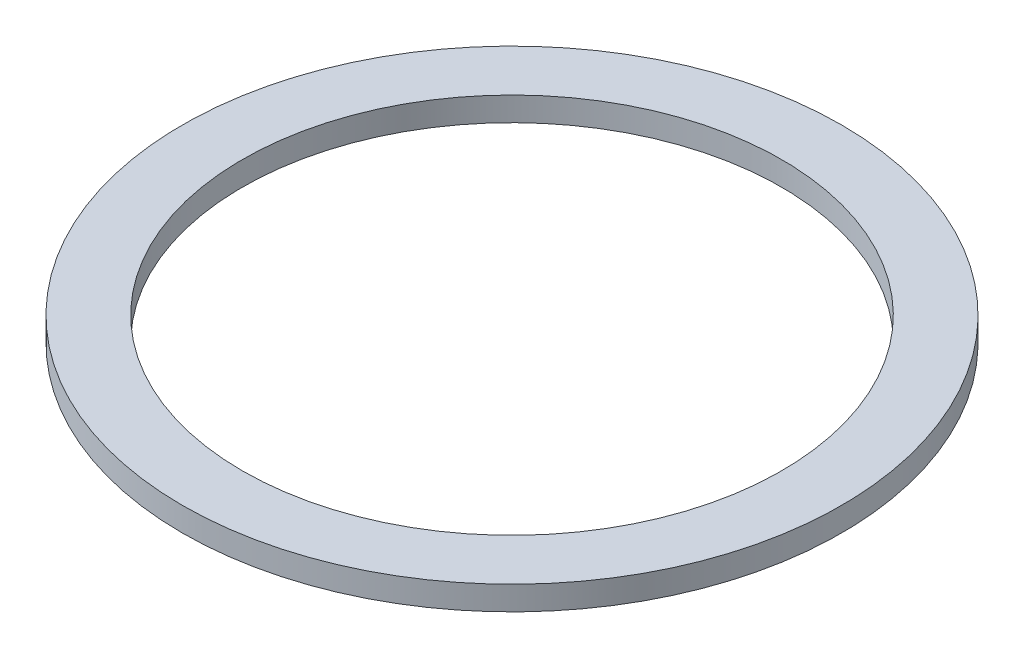
ISO-10303-21;
HEADER;
FILE_DESCRIPTION(('STEP AP214'),'2;1');
FILE_NAME('part.step','',(''),(''),'','','');
FILE_SCHEMA(('AUTOMOTIVE_DESIGN { 1 0 10303 214 1 1 1 1 }'));
ENDSEC;
DATA;
#1=APPLICATION_CONTEXT('core data for automotive mechanical design processes');
#2=APPLICATION_PROTOCOL_DEFINITION('international standard','automotive_design',2000,#1);
#3=PRODUCT_CONTEXT('',#1,'mechanical');
#4=PRODUCT('Part','Part','',(#3));
#5=PRODUCT_RELATED_PRODUCT_CATEGORY('part','',(#4));
#6=PRODUCT_DEFINITION_FORMATION('','',#4);
#7=PRODUCT_DEFINITION_CONTEXT('part definition',#1,'design');
#8=PRODUCT_DEFINITION('design','',#6,#7);
#9=PRODUCT_DEFINITION_SHAPE('','',#8);
#10=(LENGTH_UNIT() NAMED_UNIT(*) SI_UNIT(.MILLI.,.METRE.));
#11=(NAMED_UNIT(*) PLANE_ANGLE_UNIT() SI_UNIT($,.RADIAN.));
#12=(NAMED_UNIT(*) SI_UNIT($,.STERADIAN.) SOLID_ANGLE_UNIT());
#13=UNCERTAINTY_MEASURE_WITH_UNIT(LENGTH_MEASURE(1.E-05),#10,'distance_accuracy_value','');
#14=(GEOMETRIC_REPRESENTATION_CONTEXT(3) GLOBAL_UNCERTAINTY_ASSIGNED_CONTEXT((#13)) GLOBAL_UNIT_ASSIGNED_CONTEXT((#10,
#11,#12)) REPRESENTATION_CONTEXT('',''));
#15=CARTESIAN_POINT('',(0.,0.,0.));
#16=DIRECTION('',(0.,0.,1.));
#17=DIRECTION('',(1.,0.,0.));
#18=AXIS2_PLACEMENT_3D('',#15,#16,#17);
#19=CARTESIAN_POINT('',(0.,4.,0.));
#20=DIRECTION('',(0.,-1.,0.));
#21=DIRECTION('',(0.,0.,-1.));
#22=AXIS2_PLACEMENT_3D('',#19,#20,#21);
#23=CYLINDRICAL_SURFACE('',#22,55.);
#24=CARTESIAN_POINT('',(0.,4.,0.));
#25=DIRECTION('',(0.,1.,0.));
#26=DIRECTION('',(0.,0.,1.));
#27=AXIS2_PLACEMENT_3D('',#24,#25,#26);
#28=CIRCLE('',#27,55.);
#29=CARTESIAN_POINT('',(0.,4.,55.));
#30=VERTEX_POINT('',#29);
#31=EDGE_CURVE('E10',#30,#30,#28,.T.);
#32=ORIENTED_EDGE('',*,*,#31,.F.);
#33=EDGE_LOOP('',(#32));
#34=FACE_BOUND('',#33,.T.);
#35=CARTESIAN_POINT('',(0.,0.,0.));
#36=DIRECTION('',(0.,1.,0.));
#37=DIRECTION('',(0.,0.,1.));
#38=AXIS2_PLACEMENT_3D('',#35,#36,#37);
#39=CIRCLE('',#38,55.);
#40=CARTESIAN_POINT('',(0.,0.,55.));
#41=VERTEX_POINT('',#40);
#42=EDGE_CURVE('E37',#41,#41,#39,.T.);
#43=ORIENTED_EDGE('',*,*,#42,.T.);
#44=EDGE_LOOP('',(#43));
#45=FACE_BOUND('',#44,.T.);
#46=ADVANCED_FACE('F40',(#34,#45),#23,.T.);
#47=CARTESIAN_POINT('',(0.,4.,0.));
#48=DIRECTION('',(0.,1.,0.));
#49=DIRECTION('',(0.,0.,1.));
#50=AXIS2_PLACEMENT_3D('',#47,#48,#49);
#51=PLANE('',#50);
#52=CARTESIAN_POINT('',(0.,4.,0.));
#53=DIRECTION('',(0.,1.,0.));
#54=DIRECTION('',(0.,0.,1.));
#55=AXIS2_PLACEMENT_3D('',#52,#53,#54);
#56=CIRCLE('',#55,45.);
#57=CARTESIAN_POINT('',(0.,4.,45.));
#58=VERTEX_POINT('',#57);
#59=EDGE_CURVE('E50',#58,#58,#56,.T.);
#60=ORIENTED_EDGE('',*,*,#59,.F.);
#61=EDGE_LOOP('',(#60));
#62=FACE_BOUND('',#61,.T.);
#63=ORIENTED_EDGE('',*,*,#31,.T.);
#64=EDGE_LOOP('',(#63));
#65=FACE_BOUND('',#64,.T.);
#66=ADVANCED_FACE('F59',(#62,#65),#51,.T.);
#67=CARTESIAN_POINT('',(0.,0.,0.));
#68=DIRECTION('',(0.,1.,0.));
#69=DIRECTION('',(0.,0.,1.));
#70=AXIS2_PLACEMENT_3D('',#67,#68,#69);
#71=PLANE('',#70);
#72=CARTESIAN_POINT('',(0.,0.,0.));
#73=DIRECTION('',(0.,1.,0.));
#74=DIRECTION('',(0.,0.,1.));
#75=AXIS2_PLACEMENT_3D('',#72,#73,#74);
#76=CIRCLE('',#75,45.);
#77=CARTESIAN_POINT('',(0.,0.,45.));
#78=VERTEX_POINT('',#77);
#79=EDGE_CURVE('E47',#78,#78,#76,.T.);
#80=ORIENTED_EDGE('',*,*,#79,.T.);
#81=EDGE_LOOP('',(#80));
#82=FACE_BOUND('',#81,.T.);
#83=ORIENTED_EDGE('',*,*,#42,.F.);
#84=EDGE_LOOP('',(#83));
#85=FACE_BOUND('',#84,.T.);
#86=ADVANCED_FACE('F58',(#82,#85),#71,.F.);
#87=CARTESIAN_POINT('',(0.,4.,0.));
#88=DIRECTION('',(0.,-1.,0.));
#89=DIRECTION('',(0.,0.,-1.));
#90=AXIS2_PLACEMENT_3D('',#87,#88,#89);
#91=CYLINDRICAL_SURFACE('',#90,45.);
#92=ORIENTED_EDGE('',*,*,#59,.T.);
#93=EDGE_LOOP('',(#92));
#94=FACE_BOUND('',#93,.T.);
#95=ORIENTED_EDGE('',*,*,#79,.F.);
#96=EDGE_LOOP('',(#95));
#97=FACE_BOUND('',#96,.T.);
#98=ADVANCED_FACE('F54',(#94,#97),#91,.F.);
#99=CLOSED_SHELL('',(#46,#66,#86,#98));
#100=MANIFOLD_SOLID_BREP('B2',#99);
#101=ADVANCED_BREP_SHAPE_REPRESENTATION('',(#18,#100),#14);
#102=SHAPE_DEFINITION_REPRESENTATION(#9,#101);
ENDSEC;
END-ISO-10303-21;
